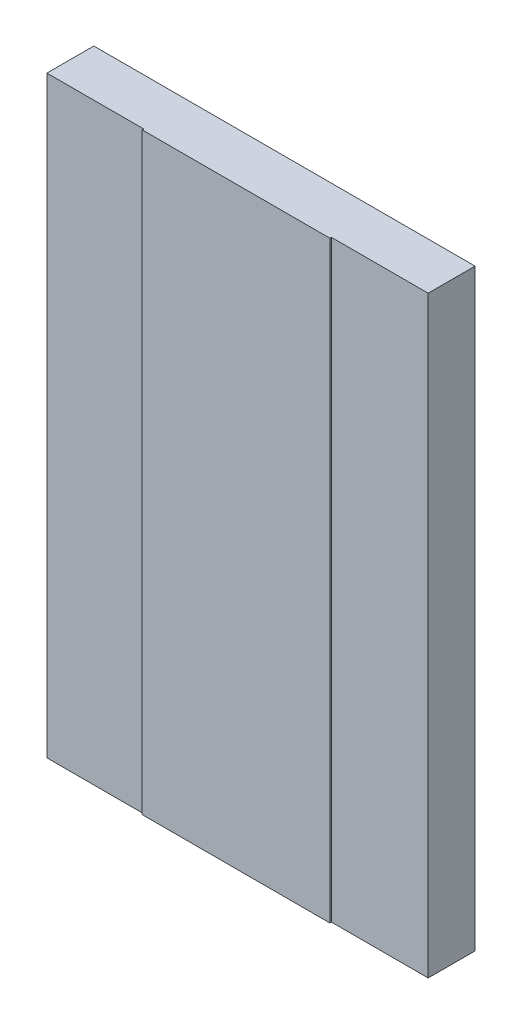
ISO-10303-21;
HEADER;
FILE_DESCRIPTION(('STEP AP214'),'2;1');
FILE_NAME('part.step','',(''),(''),'','','');
FILE_SCHEMA(('AUTOMOTIVE_DESIGN { 1 0 10303 214 1 1 1 1 }'));
ENDSEC;
DATA;
#1=APPLICATION_CONTEXT('core data for automotive mechanical design processes');
#2=APPLICATION_PROTOCOL_DEFINITION('international standard','automotive_design',2000,#1);
#3=PRODUCT_CONTEXT('',#1,'mechanical');
#4=PRODUCT('Part','Part','',(#3));
#5=PRODUCT_RELATED_PRODUCT_CATEGORY('part','',(#4));
#6=PRODUCT_DEFINITION_FORMATION('','',#4);
#7=PRODUCT_DEFINITION_CONTEXT('part definition',#1,'design');
#8=PRODUCT_DEFINITION('design','',#6,#7);
#9=PRODUCT_DEFINITION_SHAPE('','',#8);
#10=(LENGTH_UNIT() NAMED_UNIT(*) SI_UNIT(.MILLI.,.METRE.));
#11=(NAMED_UNIT(*) PLANE_ANGLE_UNIT() SI_UNIT($,.RADIAN.));
#12=(NAMED_UNIT(*) SI_UNIT($,.STERADIAN.) SOLID_ANGLE_UNIT());
#13=UNCERTAINTY_MEASURE_WITH_UNIT(LENGTH_MEASURE(1.E-05),#10,'distance_accuracy_value','');
#14=(GEOMETRIC_REPRESENTATION_CONTEXT(3) GLOBAL_UNCERTAINTY_ASSIGNED_CONTEXT((#13)) GLOBAL_UNIT_ASSIGNED_CONTEXT((#10,
#11,#12)) REPRESENTATION_CONTEXT('',''));
#15=CARTESIAN_POINT('',(0.,0.,0.));
#16=DIRECTION('',(0.,0.,1.));
#17=DIRECTION('',(1.,0.,0.));
#18=AXIS2_PLACEMENT_3D('',#15,#16,#17);
#19=CARTESIAN_POINT('',(50.00625,77.7875,6.35));
#20=DIRECTION('',(-1.,0.,0.));
#21=DIRECTION('',(0.,-1.,0.));
#22=AXIS2_PLACEMENT_3D('',#19,#20,#21);
#23=PLANE('',#22);
#24=DIRECTION('',(0.,0.,-1.));
#25=VECTOR('',#24,1.);
#26=CARTESIAN_POINT('',(50.00625,77.7875,6.35));
#27=LINE('',#26,#25);
#28=CARTESIAN_POINT('',(50.00625,77.7875,5.953125));
#29=VERTEX_POINT('',#28);
#30=CARTESIAN_POINT('',(50.00625,77.7875,-6.35));
#31=VERTEX_POINT('',#30);
#32=EDGE_CURVE('E11',#29,#31,#27,.T.);
#33=ORIENTED_EDGE('',*,*,#32,.F.);
#34=DIRECTION('',(0.,1.,0.));
#35=VECTOR('',#34,1.);
#36=CARTESIAN_POINT('',(50.00625,-77.7885,5.953125));
#37=LINE('',#36,#35);
#38=CARTESIAN_POINT('',(50.00625,-77.7875,5.953125));
#39=VERTEX_POINT('',#38);
#40=EDGE_CURVE('E100',#39,#29,#37,.T.);
#41=ORIENTED_EDGE('',*,*,#40,.F.);
#42=DIRECTION('',(0.,0.,-1.));
#43=VECTOR('',#42,1.);
#44=CARTESIAN_POINT('',(50.00625,-77.7875,6.35));
#45=LINE('',#44,#43);
#46=CARTESIAN_POINT('',(50.00625,-77.7875,-6.35));
#47=VERTEX_POINT('',#46);
#48=EDGE_CURVE('E112',#39,#47,#45,.T.);
#49=ORIENTED_EDGE('',*,*,#48,.T.);
#50=DIRECTION('',(0.,1.,0.));
#51=VECTOR('',#50,1.);
#52=CARTESIAN_POINT('',(50.00625,77.7875,-6.35));
#53=LINE('',#52,#51);
#54=EDGE_CURVE('E145',#47,#31,#53,.T.);
#55=ORIENTED_EDGE('',*,*,#54,.T.);
#56=EDGE_LOOP('',(#33,#41,#49,#55));
#57=FACE_BOUND('',#56,.T.);
#58=ADVANCED_FACE('F33',(#57),#23,.F.);
#59=CARTESIAN_POINT('',(-50.00625,77.7875,6.35));
#60=DIRECTION('',(0.,-1.,0.));
#61=DIRECTION('',(0.,0.,-1.));
#62=AXIS2_PLACEMENT_3D('',#59,#60,#61);
#63=PLANE('',#62);
#64=DIRECTION('',(-1.,0.,0.));
#65=VECTOR('',#64,1.);
#66=CARTESIAN_POINT('',(-50.00625,77.7875,6.35));
#67=LINE('',#66,#65);
#68=CARTESIAN_POINT('',(24.60625,77.7875,6.35));
#69=VERTEX_POINT('',#68);
#70=CARTESIAN_POINT('',(-24.60625,77.7875,6.35));
#71=VERTEX_POINT('',#70);
#72=EDGE_CURVE('E124',#69,#71,#67,.T.);
#73=ORIENTED_EDGE('',*,*,#72,.F.);
#74=DIRECTION('',(0.,0.,1.));
#75=VECTOR('',#74,1.);
#76=CARTESIAN_POINT('',(24.60625,77.7875,6.35));
#77=LINE('',#76,#75);
#78=CARTESIAN_POINT('',(24.60625,77.7875,5.953125));
#79=VERTEX_POINT('',#78);
#80=EDGE_CURVE('E47',#79,#69,#77,.T.);
#81=ORIENTED_EDGE('',*,*,#80,.F.);
#82=DIRECTION('',(-1.,0.,0.));
#83=VECTOR('',#82,1.);
#84=CARTESIAN_POINT('',(50.00625,77.7875,5.953125));
#85=LINE('',#84,#83);
#86=EDGE_CURVE('E168',#29,#79,#85,.T.);
#87=ORIENTED_EDGE('',*,*,#86,.F.);
#88=ORIENTED_EDGE('',*,*,#32,.T.);
#89=DIRECTION('',(-1.,0.,0.));
#90=VECTOR('',#89,1.);
#91=CARTESIAN_POINT('',(-50.00625,77.7875,-6.35));
#92=LINE('',#91,#90);
#93=CARTESIAN_POINT('',(-50.00625,77.7875,-6.35));
#94=VERTEX_POINT('',#93);
#95=EDGE_CURVE('E141',#31,#94,#92,.T.);
#96=ORIENTED_EDGE('',*,*,#95,.T.);
#97=DIRECTION('',(0.,0.,-1.));
#98=VECTOR('',#97,1.);
#99=CARTESIAN_POINT('',(-50.00625,77.7875,6.35));
#100=LINE('',#99,#98);
#101=CARTESIAN_POINT('',(-50.00625,77.7875,5.953125));
#102=VERTEX_POINT('',#101);
#103=EDGE_CURVE('E40',#102,#94,#100,.T.);
#104=ORIENTED_EDGE('',*,*,#103,.F.);
#105=DIRECTION('',(-1.,0.,0.));
#106=VECTOR('',#105,1.);
#107=CARTESIAN_POINT('',(-50.00625,77.7875,5.953125));
#108=LINE('',#107,#106);
#109=CARTESIAN_POINT('',(-24.60625,77.7875,5.953125));
#110=VERTEX_POINT('',#109);
#111=EDGE_CURVE('E154',#110,#102,#108,.T.);
#112=ORIENTED_EDGE('',*,*,#111,.F.);
#113=DIRECTION('',(0.,0.,-1.));
#114=VECTOR('',#113,1.);
#115=CARTESIAN_POINT('',(-24.60625,77.7875,6.35));
#116=LINE('',#115,#114);
#117=EDGE_CURVE('E158',#71,#110,#116,.T.);
#118=ORIENTED_EDGE('',*,*,#117,.F.);
#119=EDGE_LOOP('',(#73,#81,#87,#88,#96,#104,#112,#118));
#120=FACE_BOUND('',#119,.T.);
#121=ADVANCED_FACE('F143',(#120),#63,.F.);
#122=CARTESIAN_POINT('',(-50.00625,77.7875,6.35));
#123=DIRECTION('',(1.,0.,0.));
#124=DIRECTION('',(0.,1.,0.));
#125=AXIS2_PLACEMENT_3D('',#122,#123,#124);
#126=PLANE('',#125);
#127=DIRECTION('',(0.,0.,-1.));
#128=VECTOR('',#127,1.);
#129=CARTESIAN_POINT('',(-50.00625,-77.7875,6.35));
#130=LINE('',#129,#128);
#131=CARTESIAN_POINT('',(-50.00625,-77.7875,5.953125));
#132=VERTEX_POINT('',#131);
#133=CARTESIAN_POINT('',(-50.00625,-77.7875,-6.35));
#134=VERTEX_POINT('',#133);
#135=EDGE_CURVE('E119',#132,#134,#130,.T.);
#136=ORIENTED_EDGE('',*,*,#135,.F.);
#137=DIRECTION('',(0.,1.,0.));
#138=VECTOR('',#137,1.);
#139=CARTESIAN_POINT('',(-50.00625,-77.7885,5.953125));
#140=LINE('',#139,#138);
#141=EDGE_CURVE('E137',#132,#102,#140,.T.);
#142=ORIENTED_EDGE('',*,*,#141,.T.);
#143=ORIENTED_EDGE('',*,*,#103,.T.);
#144=DIRECTION('',(0.,-1.,0.));
#145=VECTOR('',#144,1.);
#146=CARTESIAN_POINT('',(-50.00625,77.7875,-6.35));
#147=LINE('',#146,#145);
#148=EDGE_CURVE('E136',#94,#134,#147,.T.);
#149=ORIENTED_EDGE('',*,*,#148,.T.);
#150=EDGE_LOOP('',(#136,#142,#143,#149));
#151=FACE_BOUND('',#150,.T.);
#152=ADVANCED_FACE('F134',(#151),#126,.F.);
#153=CARTESIAN_POINT('',(-50.00625,-77.7875,6.35));
#154=DIRECTION('',(0.,1.,0.));
#155=DIRECTION('',(0.,0.,1.));
#156=AXIS2_PLACEMENT_3D('',#153,#154,#155);
#157=PLANE('',#156);
#158=DIRECTION('',(1.,0.,0.));
#159=VECTOR('',#158,1.);
#160=CARTESIAN_POINT('',(50.00625,-77.7875,5.953125));
#161=LINE('',#160,#159);
#162=CARTESIAN_POINT('',(24.60625,-77.7875,5.953125));
#163=VERTEX_POINT('',#162);
#164=EDGE_CURVE('E96',#163,#39,#161,.T.);
#165=ORIENTED_EDGE('',*,*,#164,.F.);
#166=DIRECTION('',(0.,0.,-1.));
#167=VECTOR('',#166,1.);
#168=CARTESIAN_POINT('',(24.60625,-77.7875,6.35));
#169=LINE('',#168,#167);
#170=CARTESIAN_POINT('',(24.60625,-77.7875,6.35));
#171=VERTEX_POINT('',#170);
#172=EDGE_CURVE('E170',#171,#163,#169,.T.);
#173=ORIENTED_EDGE('',*,*,#172,.F.);
#174=DIRECTION('',(1.,0.,0.));
#175=VECTOR('',#174,1.);
#176=CARTESIAN_POINT('',(-50.00625,-77.7875,6.35));
#177=LINE('',#176,#175);
#178=CARTESIAN_POINT('',(-24.60625,-77.7875,6.35));
#179=VERTEX_POINT('',#178);
#180=EDGE_CURVE('E120',#179,#171,#177,.T.);
#181=ORIENTED_EDGE('',*,*,#180,.F.);
#182=DIRECTION('',(0.,0.,1.));
#183=VECTOR('',#182,1.);
#184=CARTESIAN_POINT('',(-24.60625,-77.7875,6.35));
#185=LINE('',#184,#183);
#186=CARTESIAN_POINT('',(-24.60625,-77.7875,5.953125));
#187=VERTEX_POINT('',#186);
#188=EDGE_CURVE('E55',#187,#179,#185,.T.);
#189=ORIENTED_EDGE('',*,*,#188,.F.);
#190=DIRECTION('',(1.,0.,0.));
#191=VECTOR('',#190,1.);
#192=CARTESIAN_POINT('',(-50.00625,-77.7875,5.953125));
#193=LINE('',#192,#191);
#194=EDGE_CURVE('E161',#132,#187,#193,.T.);
#195=ORIENTED_EDGE('',*,*,#194,.F.);
#196=ORIENTED_EDGE('',*,*,#135,.T.);
#197=DIRECTION('',(1.,0.,0.));
#198=VECTOR('',#197,1.);
#199=CARTESIAN_POINT('',(-50.00625,-77.7875,-6.35));
#200=LINE('',#199,#198);
#201=EDGE_CURVE('E117',#134,#47,#200,.T.);
#202=ORIENTED_EDGE('',*,*,#201,.T.);
#203=ORIENTED_EDGE('',*,*,#48,.F.);
#204=EDGE_LOOP('',(#165,#173,#181,#189,#195,#196,#202,#203));
#205=FACE_BOUND('',#204,.T.);
#206=ADVANCED_FACE('F115',(#205),#157,.F.);
#207=CARTESIAN_POINT('',(0.,0.,6.35));
#208=DIRECTION('',(0.,0.,1.));
#209=DIRECTION('',(1.,0.,0.));
#210=AXIS2_PLACEMENT_3D('',#207,#208,#209);
#211=PLANE('',#210);
#212=DIRECTION('',(0.,1.,0.));
#213=VECTOR('',#212,1.);
#214=CARTESIAN_POINT('',(24.60625,-77.7885,6.35));
#215=LINE('',#214,#213);
#216=EDGE_CURVE('E107',#171,#69,#215,.T.);
#217=ORIENTED_EDGE('',*,*,#216,.T.);
#218=ORIENTED_EDGE('',*,*,#72,.T.);
#219=DIRECTION('',(0.,1.,0.));
#220=VECTOR('',#219,1.);
#221=CARTESIAN_POINT('',(-24.60625,-77.7885,6.35));
#222=LINE('',#221,#220);
#223=EDGE_CURVE('E151',#179,#71,#222,.T.);
#224=ORIENTED_EDGE('',*,*,#223,.F.);
#225=ORIENTED_EDGE('',*,*,#180,.T.);
#226=EDGE_LOOP('',(#217,#218,#224,#225));
#227=FACE_BOUND('',#226,.T.);
#228=ADVANCED_FACE('F174',(#227),#211,.T.);
#229=CARTESIAN_POINT('',(0.,0.,-6.35));
#230=DIRECTION('',(0.,0.,1.));
#231=DIRECTION('',(1.,0.,0.));
#232=AXIS2_PLACEMENT_3D('',#229,#230,#231);
#233=PLANE('',#232);
#234=ORIENTED_EDGE('',*,*,#54,.F.);
#235=ORIENTED_EDGE('',*,*,#201,.F.);
#236=ORIENTED_EDGE('',*,*,#148,.F.);
#237=ORIENTED_EDGE('',*,*,#95,.F.);
#238=EDGE_LOOP('',(#234,#235,#236,#237));
#239=FACE_BOUND('',#238,.T.);
#240=ADVANCED_FACE('F147',(#239),#233,.F.);
#241=CARTESIAN_POINT('',(-50.00625,-77.7885,5.953125));
#242=DIRECTION('',(0.,0.,-1.));
#243=DIRECTION('',(-1.,0.,0.));
#244=AXIS2_PLACEMENT_3D('',#241,#242,#243);
#245=PLANE('',#244);
#246=ORIENTED_EDGE('',*,*,#194,.T.);
#247=DIRECTION('',(0.,1.,0.));
#248=VECTOR('',#247,1.);
#249=CARTESIAN_POINT('',(-24.60625,-77.7885,5.953125));
#250=LINE('',#249,#248);
#251=EDGE_CURVE('E153',#187,#110,#250,.T.);
#252=ORIENTED_EDGE('',*,*,#251,.T.);
#253=ORIENTED_EDGE('',*,*,#111,.T.);
#254=ORIENTED_EDGE('',*,*,#141,.F.);
#255=EDGE_LOOP('',(#246,#252,#253,#254));
#256=FACE_BOUND('',#255,.T.);
#257=ADVANCED_FACE('F178',(#256),#245,.F.);
#258=CARTESIAN_POINT('',(-24.60625,-77.7885,6.35));
#259=DIRECTION('',(1.,0.,0.));
#260=DIRECTION('',(0.,0.,-1.));
#261=AXIS2_PLACEMENT_3D('',#258,#259,#260);
#262=PLANE('',#261);
#263=ORIENTED_EDGE('',*,*,#188,.T.);
#264=ORIENTED_EDGE('',*,*,#223,.T.);
#265=ORIENTED_EDGE('',*,*,#117,.T.);
#266=ORIENTED_EDGE('',*,*,#251,.F.);
#267=EDGE_LOOP('',(#263,#264,#265,#266));
#268=FACE_BOUND('',#267,.T.);
#269=ADVANCED_FACE('F176',(#268),#262,.F.);
#270=CARTESIAN_POINT('',(24.60625,-77.7885,6.35));
#271=DIRECTION('',(-1.,0.,0.));
#272=DIRECTION('',(0.,0.,1.));
#273=AXIS2_PLACEMENT_3D('',#270,#271,#272);
#274=PLANE('',#273);
#275=ORIENTED_EDGE('',*,*,#172,.T.);
#276=DIRECTION('',(0.,1.,0.));
#277=VECTOR('',#276,1.);
#278=CARTESIAN_POINT('',(24.60625,-77.7885,5.953125));
#279=LINE('',#278,#277);
#280=EDGE_CURVE('E102',#163,#79,#279,.T.);
#281=ORIENTED_EDGE('',*,*,#280,.T.);
#282=ORIENTED_EDGE('',*,*,#80,.T.);
#283=ORIENTED_EDGE('',*,*,#216,.F.);
#284=EDGE_LOOP('',(#275,#281,#282,#283));
#285=FACE_BOUND('',#284,.T.);
#286=ADVANCED_FACE('F171',(#285),#274,.F.);
#287=CARTESIAN_POINT('',(50.00625,-77.7885,5.953125));
#288=DIRECTION('',(0.,0.,-1.));
#289=DIRECTION('',(-1.,0.,0.));
#290=AXIS2_PLACEMENT_3D('',#287,#288,#289);
#291=PLANE('',#290);
#292=ORIENTED_EDGE('',*,*,#164,.T.);
#293=ORIENTED_EDGE('',*,*,#40,.T.);
#294=ORIENTED_EDGE('',*,*,#86,.T.);
#295=ORIENTED_EDGE('',*,*,#280,.F.);
#296=EDGE_LOOP('',(#292,#293,#294,#295));
#297=FACE_BOUND('',#296,.T.);
#298=ADVANCED_FACE('F98',(#297),#291,.F.);
#299=CLOSED_SHELL('',(#58,#121,#152,#206,#228,#240,#257,#269,#286,#298));
#300=MANIFOLD_SOLID_BREP('B2',#299);
#301=ADVANCED_BREP_SHAPE_REPRESENTATION('',(#18,#300),#14);
#302=SHAPE_DEFINITION_REPRESENTATION(#9,#301);
ENDSEC;
END-ISO-10303-21;
